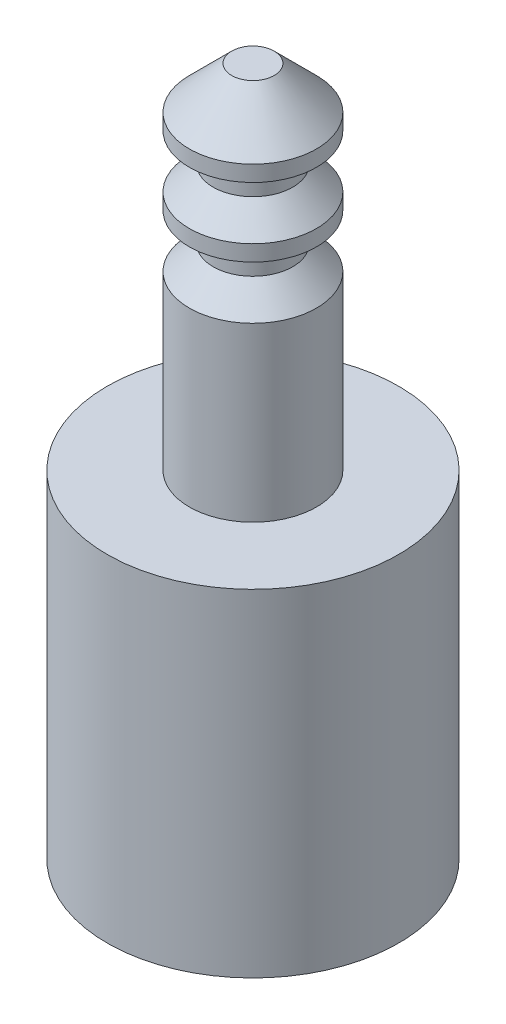
ISO-10303-21;
HEADER;
FILE_DESCRIPTION(('STEP AP214'),'2;1');
FILE_NAME('part.step','',(''),(''),'','','');
FILE_SCHEMA(('AUTOMOTIVE_DESIGN { 1 0 10303 214 1 1 1 1 }'));
ENDSEC;
DATA;
#1=APPLICATION_CONTEXT('core data for automotive mechanical design processes');
#2=APPLICATION_PROTOCOL_DEFINITION('international standard','automotive_design',2000,#1);
#3=PRODUCT_CONTEXT('',#1,'mechanical');
#4=PRODUCT('Part','Part','',(#3));
#5=PRODUCT_RELATED_PRODUCT_CATEGORY('part','',(#4));
#6=PRODUCT_DEFINITION_FORMATION('','',#4);
#7=PRODUCT_DEFINITION_CONTEXT('part definition',#1,'design');
#8=PRODUCT_DEFINITION('design','',#6,#7);
#9=PRODUCT_DEFINITION_SHAPE('','',#8);
#10=(LENGTH_UNIT() NAMED_UNIT(*) SI_UNIT(.MILLI.,.METRE.));
#11=(NAMED_UNIT(*) PLANE_ANGLE_UNIT() SI_UNIT($,.RADIAN.));
#12=(NAMED_UNIT(*) SI_UNIT($,.STERADIAN.) SOLID_ANGLE_UNIT());
#13=UNCERTAINTY_MEASURE_WITH_UNIT(LENGTH_MEASURE(1.E-05),#10,'distance_accuracy_value','');
#14=(GEOMETRIC_REPRESENTATION_CONTEXT(3) GLOBAL_UNCERTAINTY_ASSIGNED_CONTEXT((#13)) GLOBAL_UNIT_ASSIGNED_CONTEXT((#10,
#11,#12)) REPRESENTATION_CONTEXT('',''));
#15=CARTESIAN_POINT('',(0.,0.,0.));
#16=DIRECTION('',(0.,0.,1.));
#17=DIRECTION('',(1.,0.,0.));
#18=AXIS2_PLACEMENT_3D('',#15,#16,#17);
#19=CARTESIAN_POINT('',(0.,13.,0.));
#20=DIRECTION('',(0.,-1.,0.));
#21=DIRECTION('',(1.,0.,0.));
#22=AXIS2_PLACEMENT_3D('',#19,#20,#21);
#23=PLANE('',#22);
#24=CARTESIAN_POINT('',(0.,13.,0.));
#25=DIRECTION('',(0.,1.,0.));
#26=DIRECTION('',(-1.,0.,0.));
#27=AXIS2_PLACEMENT_3D('',#24,#25,#26);
#28=CIRCLE('',#27,0.4);
#29=CARTESIAN_POINT('',(-0.400000000000002,13.,0.));
#30=VERTEX_POINT('',#29);
#31=EDGE_CURVE('E10',#30,#30,#28,.T.);
#32=ORIENTED_EDGE('',*,*,#31,.T.);
#33=EDGE_LOOP('',(#32));
#34=FACE_BOUND('',#33,.T.);
#35=ADVANCED_FACE('F28',(#34),#23,.F.);
#36=CARTESIAN_POINT('',(0.,12.2,0.));
#37=DIRECTION('',(0.,-1.,0.));
#38=DIRECTION('',(1.,0.,0.));
#39=AXIS2_PLACEMENT_3D('',#36,#37,#38);
#40=CONICAL_SURFACE('',#39,1.2,0.785398163397448);
#41=ORIENTED_EDGE('',*,*,#31,.F.);
#42=EDGE_LOOP('',(#41));
#43=FACE_BOUND('',#42,.T.);
#44=CARTESIAN_POINT('',(0.,12.2,0.));
#45=DIRECTION('',(0.,1.,0.));
#46=DIRECTION('',(-1.,0.,0.));
#47=AXIS2_PLACEMENT_3D('',#44,#45,#46);
#48=CIRCLE('',#47,1.2);
#49=CARTESIAN_POINT('',(-1.2,12.2,0.));
#50=VERTEX_POINT('',#49);
#51=EDGE_CURVE('E34',#50,#50,#48,.T.);
#52=ORIENTED_EDGE('',*,*,#51,.T.);
#53=EDGE_LOOP('',(#52));
#54=FACE_BOUND('',#53,.T.);
#55=ADVANCED_FACE('F87',(#43,#54),#40,.T.);
#56=CARTESIAN_POINT('',(0.,0.,0.));
#57=DIRECTION('',(0.,1.,0.));
#58=DIRECTION('',(-1.,0.,0.));
#59=AXIS2_PLACEMENT_3D('',#56,#57,#58);
#60=CYLINDRICAL_SURFACE('',#59,1.2);
#61=ORIENTED_EDGE('',*,*,#51,.F.);
#62=EDGE_LOOP('',(#61));
#63=FACE_BOUND('',#62,.T.);
#64=CARTESIAN_POINT('',(0.,11.9,0.));
#65=DIRECTION('',(0.,1.,0.));
#66=DIRECTION('',(-1.,0.,0.));
#67=AXIS2_PLACEMENT_3D('',#64,#65,#66);
#68=CIRCLE('',#67,1.2);
#69=CARTESIAN_POINT('',(-1.2,11.9,0.));
#70=VERTEX_POINT('',#69);
#71=EDGE_CURVE('E38',#70,#70,#68,.T.);
#72=ORIENTED_EDGE('',*,*,#71,.T.);
#73=EDGE_LOOP('',(#72));
#74=FACE_BOUND('',#73,.T.);
#75=ADVANCED_FACE('F91',(#63,#74),#60,.T.);
#76=CARTESIAN_POINT('',(0.749999999999999,11.9,0.));
#77=DIRECTION('',(0.,1.,0.));
#78=DIRECTION('',(-1.,0.,0.));
#79=AXIS2_PLACEMENT_3D('',#76,#77,#78);
#80=PLANE('',#79);
#81=ORIENTED_EDGE('',*,*,#71,.F.);
#82=EDGE_LOOP('',(#81));
#83=FACE_BOUND('',#82,.T.);
#84=CARTESIAN_POINT('',(0.,11.9,0.));
#85=DIRECTION('',(0.,1.,0.));
#86=DIRECTION('',(-1.,0.,0.));
#87=AXIS2_PLACEMENT_3D('',#84,#85,#86);
#88=CIRCLE('',#87,0.75);
#89=CARTESIAN_POINT('',(-0.750000000000002,11.9,0.));
#90=VERTEX_POINT('',#89);
#91=EDGE_CURVE('E42',#90,#90,#88,.T.);
#92=ORIENTED_EDGE('',*,*,#91,.T.);
#93=EDGE_LOOP('',(#92));
#94=FACE_BOUND('',#93,.T.);
#95=ADVANCED_FACE('F96',(#83,#94),#80,.F.);
#96=CARTESIAN_POINT('',(0.,0.,0.));
#97=DIRECTION('',(0.,1.,0.));
#98=DIRECTION('',(-1.,0.,0.));
#99=AXIS2_PLACEMENT_3D('',#96,#97,#98);
#100=CYLINDRICAL_SURFACE('',#99,0.75);
#101=ORIENTED_EDGE('',*,*,#91,.F.);
#102=EDGE_LOOP('',(#101));
#103=FACE_BOUND('',#102,.T.);
#104=CARTESIAN_POINT('',(0.,11.35,0.));
#105=DIRECTION('',(0.,1.,0.));
#106=DIRECTION('',(-1.,0.,0.));
#107=AXIS2_PLACEMENT_3D('',#104,#105,#106);
#108=CIRCLE('',#107,0.75);
#109=CARTESIAN_POINT('',(-0.750000000000002,11.35,0.));
#110=VERTEX_POINT('',#109);
#111=EDGE_CURVE('E47',#110,#110,#108,.T.);
#112=ORIENTED_EDGE('',*,*,#111,.T.);
#113=EDGE_LOOP('',(#112));
#114=FACE_BOUND('',#113,.T.);
#115=ADVANCED_FACE('F102',(#103,#114),#100,.T.);
#116=CARTESIAN_POINT('',(0.,10.9,0.));
#117=DIRECTION('',(0.,-1.,0.));
#118=DIRECTION('',(1.,0.,0.));
#119=AXIS2_PLACEMENT_3D('',#116,#117,#118);
#120=CONICAL_SURFACE('',#119,1.2,0.785398163397455);
#121=ORIENTED_EDGE('',*,*,#111,.F.);
#122=EDGE_LOOP('',(#121));
#123=FACE_BOUND('',#122,.T.);
#124=CARTESIAN_POINT('',(0.,10.9,0.));
#125=DIRECTION('',(0.,1.,0.));
#126=DIRECTION('',(-1.,0.,0.));
#127=AXIS2_PLACEMENT_3D('',#124,#125,#126);
#128=CIRCLE('',#127,1.2);
#129=CARTESIAN_POINT('',(-1.2,10.9,0.));
#130=VERTEX_POINT('',#129);
#131=EDGE_CURVE('E50',#130,#130,#128,.T.);
#132=ORIENTED_EDGE('',*,*,#131,.T.);
#133=EDGE_LOOP('',(#132));
#134=FACE_BOUND('',#133,.T.);
#135=ADVANCED_FACE('F106',(#123,#134),#120,.T.);
#136=CARTESIAN_POINT('',(0.,0.,0.));
#137=DIRECTION('',(0.,1.,0.));
#138=DIRECTION('',(-1.,0.,0.));
#139=AXIS2_PLACEMENT_3D('',#136,#137,#138);
#140=CYLINDRICAL_SURFACE('',#139,1.2);
#141=ORIENTED_EDGE('',*,*,#131,.F.);
#142=EDGE_LOOP('',(#141));
#143=FACE_BOUND('',#142,.T.);
#144=CARTESIAN_POINT('',(0.,10.6,0.));
#145=DIRECTION('',(0.,1.,0.));
#146=DIRECTION('',(-1.,0.,0.));
#147=AXIS2_PLACEMENT_3D('',#144,#145,#146);
#148=CIRCLE('',#147,1.2);
#149=CARTESIAN_POINT('',(-1.2,10.6,0.));
#150=VERTEX_POINT('',#149);
#151=EDGE_CURVE('E53',#150,#150,#148,.T.);
#152=ORIENTED_EDGE('',*,*,#151,.T.);
#153=EDGE_LOOP('',(#152));
#154=FACE_BOUND('',#153,.T.);
#155=ADVANCED_FACE('F110',(#143,#154),#140,.T.);
#156=CARTESIAN_POINT('',(0.749999999999999,10.6,0.));
#157=DIRECTION('',(0.,1.,0.));
#158=DIRECTION('',(-1.,0.,0.));
#159=AXIS2_PLACEMENT_3D('',#156,#157,#158);
#160=PLANE('',#159);
#161=ORIENTED_EDGE('',*,*,#151,.F.);
#162=EDGE_LOOP('',(#161));
#163=FACE_BOUND('',#162,.T.);
#164=CARTESIAN_POINT('',(0.,10.6,0.));
#165=DIRECTION('',(0.,1.,0.));
#166=DIRECTION('',(-1.,0.,0.));
#167=AXIS2_PLACEMENT_3D('',#164,#165,#166);
#168=CIRCLE('',#167,0.75);
#169=CARTESIAN_POINT('',(-0.750000000000002,10.6,0.));
#170=VERTEX_POINT('',#169);
#171=EDGE_CURVE('E56',#170,#170,#168,.T.);
#172=ORIENTED_EDGE('',*,*,#171,.T.);
#173=EDGE_LOOP('',(#172));
#174=FACE_BOUND('',#173,.T.);
#175=ADVANCED_FACE('F114',(#163,#174),#160,.F.);
#176=CARTESIAN_POINT('',(0.,0.,0.));
#177=DIRECTION('',(0.,1.,0.));
#178=DIRECTION('',(-1.,0.,0.));
#179=AXIS2_PLACEMENT_3D('',#176,#177,#178);
#180=CYLINDRICAL_SURFACE('',#179,0.75);
#181=ORIENTED_EDGE('',*,*,#171,.F.);
#182=EDGE_LOOP('',(#181));
#183=FACE_BOUND('',#182,.T.);
#184=CARTESIAN_POINT('',(0.,10.05,0.));
#185=DIRECTION('',(0.,1.,0.));
#186=DIRECTION('',(-1.,0.,0.));
#187=AXIS2_PLACEMENT_3D('',#184,#185,#186);
#188=CIRCLE('',#187,0.75);
#189=CARTESIAN_POINT('',(-0.750000000000001,10.05,0.));
#190=VERTEX_POINT('',#189);
#191=EDGE_CURVE('E59',#190,#190,#188,.T.);
#192=ORIENTED_EDGE('',*,*,#191,.T.);
#193=EDGE_LOOP('',(#192));
#194=FACE_BOUND('',#193,.T.);
#195=ADVANCED_FACE('F118',(#183,#194),#180,.T.);
#196=CARTESIAN_POINT('',(0.,9.59999999999999,0.));
#197=DIRECTION('',(0.,-1.,0.));
#198=DIRECTION('',(1.,0.,0.));
#199=AXIS2_PLACEMENT_3D('',#196,#197,#198);
#200=CONICAL_SURFACE('',#199,1.2,0.785398163397455);
#201=ORIENTED_EDGE('',*,*,#191,.F.);
#202=EDGE_LOOP('',(#201));
#203=FACE_BOUND('',#202,.T.);
#204=CARTESIAN_POINT('',(0.,9.59999999999999,0.));
#205=DIRECTION('',(0.,1.,0.));
#206=DIRECTION('',(-1.,0.,0.));
#207=AXIS2_PLACEMENT_3D('',#204,#205,#206);
#208=CIRCLE('',#207,1.2);
#209=CARTESIAN_POINT('',(-1.2,9.59999999999999,0.));
#210=VERTEX_POINT('',#209);
#211=EDGE_CURVE('E62',#210,#210,#208,.T.);
#212=ORIENTED_EDGE('',*,*,#211,.T.);
#213=EDGE_LOOP('',(#212));
#214=FACE_BOUND('',#213,.T.);
#215=ADVANCED_FACE('F122',(#203,#214),#200,.T.);
#216=CARTESIAN_POINT('',(0.,0.,0.));
#217=DIRECTION('',(0.,1.,0.));
#218=DIRECTION('',(-1.,0.,0.));
#219=AXIS2_PLACEMENT_3D('',#216,#217,#218);
#220=CYLINDRICAL_SURFACE('',#219,1.2);
#221=ORIENTED_EDGE('',*,*,#211,.F.);
#222=EDGE_LOOP('',(#221));
#223=FACE_BOUND('',#222,.T.);
#224=CARTESIAN_POINT('',(0.,6.35,0.));
#225=DIRECTION('',(0.,1.,0.));
#226=DIRECTION('',(-1.,0.,0.));
#227=AXIS2_PLACEMENT_3D('',#224,#225,#226);
#228=CIRCLE('',#227,1.2);
#229=CARTESIAN_POINT('',(-1.2,6.35,0.));
#230=VERTEX_POINT('',#229);
#231=EDGE_CURVE('E65',#230,#230,#228,.T.);
#232=ORIENTED_EDGE('',*,*,#231,.T.);
#233=EDGE_LOOP('',(#232));
#234=FACE_BOUND('',#233,.T.);
#235=ADVANCED_FACE('F126',(#223,#234),#220,.T.);
#236=CARTESIAN_POINT('',(2.75,6.35,0.));
#237=DIRECTION('',(0.,-1.,0.));
#238=DIRECTION('',(1.,0.,0.));
#239=AXIS2_PLACEMENT_3D('',#236,#237,#238);
#240=PLANE('',#239);
#241=ORIENTED_EDGE('',*,*,#231,.F.);
#242=EDGE_LOOP('',(#241));
#243=FACE_BOUND('',#242,.T.);
#244=CARTESIAN_POINT('',(0.,6.35,0.));
#245=DIRECTION('',(0.,1.,0.));
#246=DIRECTION('',(-1.,0.,0.));
#247=AXIS2_PLACEMENT_3D('',#244,#245,#246);
#248=CIRCLE('',#247,2.75);
#249=CARTESIAN_POINT('',(-2.75,6.35,0.));
#250=VERTEX_POINT('',#249);
#251=EDGE_CURVE('E68',#250,#250,#248,.T.);
#252=ORIENTED_EDGE('',*,*,#251,.T.);
#253=EDGE_LOOP('',(#252));
#254=FACE_BOUND('',#253,.T.);
#255=ADVANCED_FACE('F83',(#243,#254),#240,.F.);
#256=CARTESIAN_POINT('',(0.,0.,0.));
#257=DIRECTION('',(0.,1.,0.));
#258=DIRECTION('',(-1.,0.,0.));
#259=AXIS2_PLACEMENT_3D('',#256,#257,#258);
#260=CYLINDRICAL_SURFACE('',#259,2.75);
#261=ORIENTED_EDGE('',*,*,#251,.F.);
#262=EDGE_LOOP('',(#261));
#263=FACE_BOUND('',#262,.T.);
#264=CARTESIAN_POINT('',(0.,0.,0.));
#265=DIRECTION('',(0.,1.,0.));
#266=DIRECTION('',(-1.,0.,0.));
#267=AXIS2_PLACEMENT_3D('',#264,#265,#266);
#268=CIRCLE('',#267,2.75);
#269=CARTESIAN_POINT('',(-2.75,0.,0.));
#270=VERTEX_POINT('',#269);
#271=EDGE_CURVE('E71',#270,#270,#268,.T.);
#272=ORIENTED_EDGE('',*,*,#271,.T.);
#273=EDGE_LOOP('',(#272));
#274=FACE_BOUND('',#273,.T.);
#275=ADVANCED_FACE('F75',(#263,#274),#260,.T.);
#276=CARTESIAN_POINT('',(0.,0.,0.));
#277=DIRECTION('',(0.,1.,0.));
#278=DIRECTION('',(-1.,0.,0.));
#279=AXIS2_PLACEMENT_3D('',#276,#277,#278);
#280=PLANE('',#279);
#281=ORIENTED_EDGE('',*,*,#271,.F.);
#282=EDGE_LOOP('',(#281));
#283=FACE_BOUND('',#282,.T.);
#284=ADVANCED_FACE('F77',(#283),#280,.F.);
#285=CLOSED_SHELL('',(#35,#55,#75,#95,#115,#135,#155,#175,#195,#215,#235,#255,#275,#284));
#286=MANIFOLD_SOLID_BREP('B2',#285);
#287=ADVANCED_BREP_SHAPE_REPRESENTATION('',(#18,#286),#14);
#288=SHAPE_DEFINITION_REPRESENTATION(#9,#287);
ENDSEC;
END-ISO-10303-21;
